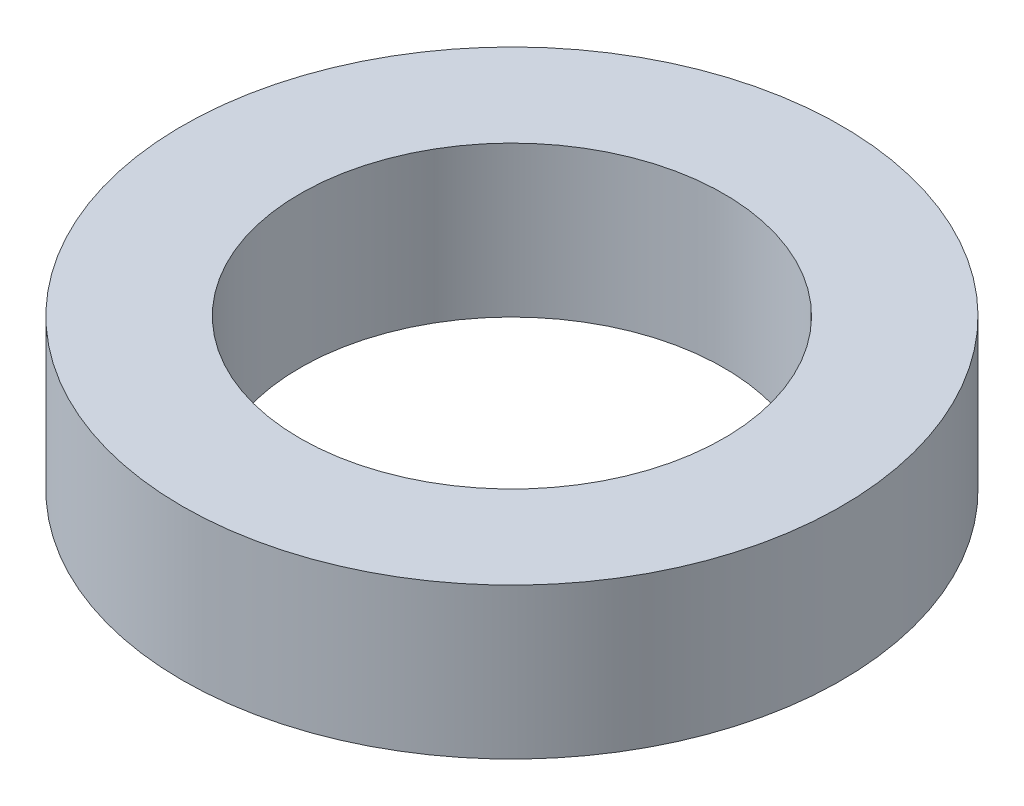
ISO-10303-21;
HEADER;
FILE_DESCRIPTION(('STEP AP214'),'2;1');
FILE_NAME('part.step','',(''),(''),'','','');
FILE_SCHEMA(('AUTOMOTIVE_DESIGN { 1 0 10303 214 1 1 1 1 }'));
ENDSEC;
DATA;
#1=APPLICATION_CONTEXT('core data for automotive mechanical design processes');
#2=APPLICATION_PROTOCOL_DEFINITION('international standard','automotive_design',2000,#1);
#3=PRODUCT_CONTEXT('',#1,'mechanical');
#4=PRODUCT('Part','Part','',(#3));
#5=PRODUCT_RELATED_PRODUCT_CATEGORY('part','',(#4));
#6=PRODUCT_DEFINITION_FORMATION('','',#4);
#7=PRODUCT_DEFINITION_CONTEXT('part definition',#1,'design');
#8=PRODUCT_DEFINITION('design','',#6,#7);
#9=PRODUCT_DEFINITION_SHAPE('','',#8);
#10=(LENGTH_UNIT() NAMED_UNIT(*) SI_UNIT(.MILLI.,.METRE.));
#11=(NAMED_UNIT(*) PLANE_ANGLE_UNIT() SI_UNIT($,.RADIAN.));
#12=(NAMED_UNIT(*) SI_UNIT($,.STERADIAN.) SOLID_ANGLE_UNIT());
#13=UNCERTAINTY_MEASURE_WITH_UNIT(LENGTH_MEASURE(1.E-05),#10,'distance_accuracy_value','');
#14=(GEOMETRIC_REPRESENTATION_CONTEXT(3) GLOBAL_UNCERTAINTY_ASSIGNED_CONTEXT((#13)) GLOBAL_UNIT_ASSIGNED_CONTEXT((#10,
#11,#12)) REPRESENTATION_CONTEXT('',''));
#15=CARTESIAN_POINT('',(0.,0.,0.));
#16=DIRECTION('',(0.,0.,1.));
#17=DIRECTION('',(1.,0.,0.));
#18=AXIS2_PLACEMENT_3D('',#15,#16,#17);
#19=CARTESIAN_POINT('',(0.,16.,0.));
#20=DIRECTION('',(0.,-1.,0.));
#21=DIRECTION('',(0.,0.,-1.));
#22=AXIS2_PLACEMENT_3D('',#19,#20,#21);
#23=CYLINDRICAL_SURFACE('',#22,35.);
#24=CARTESIAN_POINT('',(0.,16.,0.));
#25=DIRECTION('',(0.,1.,0.));
#26=DIRECTION('',(0.,0.,1.));
#27=AXIS2_PLACEMENT_3D('',#24,#25,#26);
#28=CIRCLE('',#27,35.);
#29=CARTESIAN_POINT('',(0.,16.,35.));
#30=VERTEX_POINT('',#29);
#31=EDGE_CURVE('E10',#30,#30,#28,.T.);
#32=ORIENTED_EDGE('',*,*,#31,.F.);
#33=EDGE_LOOP('',(#32));
#34=FACE_BOUND('',#33,.T.);
#35=CARTESIAN_POINT('',(0.,0.,0.));
#36=DIRECTION('',(0.,1.,0.));
#37=DIRECTION('',(0.,0.,1.));
#38=AXIS2_PLACEMENT_3D('',#35,#36,#37);
#39=CIRCLE('',#38,35.);
#40=CARTESIAN_POINT('',(0.,0.,35.));
#41=VERTEX_POINT('',#40);
#42=EDGE_CURVE('E37',#41,#41,#39,.T.);
#43=ORIENTED_EDGE('',*,*,#42,.T.);
#44=EDGE_LOOP('',(#43));
#45=FACE_BOUND('',#44,.T.);
#46=ADVANCED_FACE('F40',(#34,#45),#23,.T.);
#47=CARTESIAN_POINT('',(0.,16.,0.));
#48=DIRECTION('',(0.,1.,0.));
#49=DIRECTION('',(0.,0.,1.));
#50=AXIS2_PLACEMENT_3D('',#47,#48,#49);
#51=PLANE('',#50);
#52=CARTESIAN_POINT('',(0.,16.,0.));
#53=DIRECTION('',(0.,1.,0.));
#54=DIRECTION('',(0.,0.,1.));
#55=AXIS2_PLACEMENT_3D('',#52,#53,#54);
#56=CIRCLE('',#55,22.5);
#57=CARTESIAN_POINT('',(0.,16.,22.5));
#58=VERTEX_POINT('',#57);
#59=EDGE_CURVE('E50',#58,#58,#56,.T.);
#60=ORIENTED_EDGE('',*,*,#59,.F.);
#61=EDGE_LOOP('',(#60));
#62=FACE_BOUND('',#61,.T.);
#63=ORIENTED_EDGE('',*,*,#31,.T.);
#64=EDGE_LOOP('',(#63));
#65=FACE_BOUND('',#64,.T.);
#66=ADVANCED_FACE('F59',(#62,#65),#51,.T.);
#67=CARTESIAN_POINT('',(0.,0.,0.));
#68=DIRECTION('',(0.,1.,0.));
#69=DIRECTION('',(0.,0.,1.));
#70=AXIS2_PLACEMENT_3D('',#67,#68,#69);
#71=PLANE('',#70);
#72=CARTESIAN_POINT('',(0.,0.,0.));
#73=DIRECTION('',(0.,1.,0.));
#74=DIRECTION('',(0.,0.,1.));
#75=AXIS2_PLACEMENT_3D('',#72,#73,#74);
#76=CIRCLE('',#75,22.5);
#77=CARTESIAN_POINT('',(0.,0.,22.5));
#78=VERTEX_POINT('',#77);
#79=EDGE_CURVE('E47',#78,#78,#76,.T.);
#80=ORIENTED_EDGE('',*,*,#79,.T.);
#81=EDGE_LOOP('',(#80));
#82=FACE_BOUND('',#81,.T.);
#83=ORIENTED_EDGE('',*,*,#42,.F.);
#84=EDGE_LOOP('',(#83));
#85=FACE_BOUND('',#84,.T.);
#86=ADVANCED_FACE('F58',(#82,#85),#71,.F.);
#87=CARTESIAN_POINT('',(0.,16.,0.));
#88=DIRECTION('',(0.,-1.,0.));
#89=DIRECTION('',(0.,0.,-1.));
#90=AXIS2_PLACEMENT_3D('',#87,#88,#89);
#91=CYLINDRICAL_SURFACE('',#90,22.5);
#92=ORIENTED_EDGE('',*,*,#59,.T.);
#93=EDGE_LOOP('',(#92));
#94=FACE_BOUND('',#93,.T.);
#95=ORIENTED_EDGE('',*,*,#79,.F.);
#96=EDGE_LOOP('',(#95));
#97=FACE_BOUND('',#96,.T.);
#98=ADVANCED_FACE('F54',(#94,#97),#91,.F.);
#99=CLOSED_SHELL('',(#46,#66,#86,#98));
#100=MANIFOLD_SOLID_BREP('B2',#99);
#101=ADVANCED_BREP_SHAPE_REPRESENTATION('',(#18,#100),#14);
#102=SHAPE_DEFINITION_REPRESENTATION(#9,#101);
ENDSEC;
END-ISO-10303-21;
